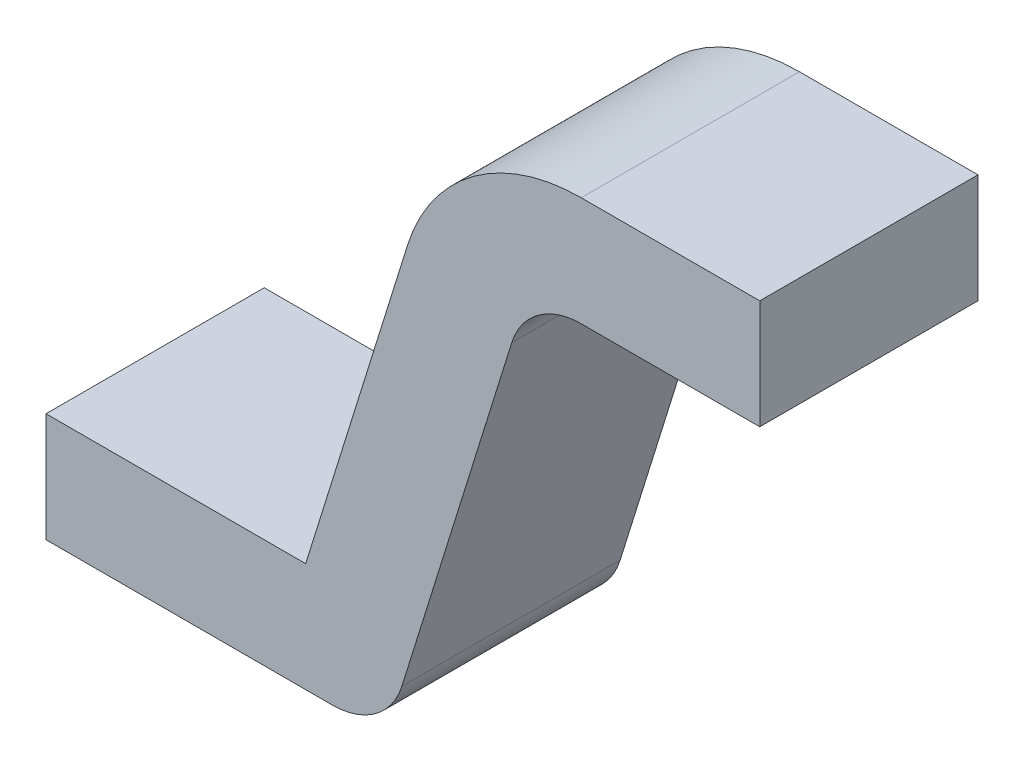
ISO-10303-21;
HEADER;
FILE_DESCRIPTION(('STEP AP214'),'2;1');
FILE_NAME('part.step','',(''),(''),'','','');
FILE_SCHEMA(('AUTOMOTIVE_DESIGN { 1 0 10303 214 1 1 1 1 }'));
ENDSEC;
DATA;
#1=APPLICATION_CONTEXT('core data for automotive mechanical design processes');
#2=APPLICATION_PROTOCOL_DEFINITION('international standard','automotive_design',2000,#1);
#3=PRODUCT_CONTEXT('',#1,'mechanical');
#4=PRODUCT('Part','Part','',(#3));
#5=PRODUCT_RELATED_PRODUCT_CATEGORY('part','',(#4));
#6=PRODUCT_DEFINITION_FORMATION('','',#4);
#7=PRODUCT_DEFINITION_CONTEXT('part definition',#1,'design');
#8=PRODUCT_DEFINITION('design','',#6,#7);
#9=PRODUCT_DEFINITION_SHAPE('','',#8);
#10=(LENGTH_UNIT() NAMED_UNIT(*) SI_UNIT(.MILLI.,.METRE.));
#11=(NAMED_UNIT(*) PLANE_ANGLE_UNIT() SI_UNIT($,.RADIAN.));
#12=(NAMED_UNIT(*) SI_UNIT($,.STERADIAN.) SOLID_ANGLE_UNIT());
#13=UNCERTAINTY_MEASURE_WITH_UNIT(LENGTH_MEASURE(1.E-05),#10,'distance_accuracy_value','');
#14=(GEOMETRIC_REPRESENTATION_CONTEXT(3) GLOBAL_UNCERTAINTY_ASSIGNED_CONTEXT((#13)) GLOBAL_UNIT_ASSIGNED_CONTEXT((#10,
#11,#12)) REPRESENTATION_CONTEXT('',''));
#15=CARTESIAN_POINT('',(0.,0.,0.));
#16=DIRECTION('',(0.,0.,1.));
#17=DIRECTION('',(1.,0.,0.));
#18=AXIS2_PLACEMENT_3D('',#15,#16,#17);
#19=CARTESIAN_POINT('',(0.,0.15,0.3));
#20=DIRECTION('',(1.,0.,0.));
#21=DIRECTION('',(0.,0.,-1.));
#22=AXIS2_PLACEMENT_3D('',#19,#20,#21);
#23=PLANE('',#22);
#24=DIRECTION('',(0.,-1.,0.));
#25=VECTOR('',#24,1.);
#26=CARTESIAN_POINT('',(0.,0.15,0.));
#27=LINE('',#26,#25);
#28=CARTESIAN_POINT('',(0.,0.15,0.));
#29=VERTEX_POINT('',#28);
#30=CARTESIAN_POINT('',(0.,0.,0.));
#31=VERTEX_POINT('',#30);
#32=EDGE_CURVE('E145',#29,#31,#27,.T.);
#33=ORIENTED_EDGE('',*,*,#32,.T.);
#34=DIRECTION('',(0.,0.,-1.));
#35=VECTOR('',#34,1.);
#36=CARTESIAN_POINT('',(0.,0.,0.3));
#37=LINE('',#36,#35);
#38=CARTESIAN_POINT('',(0.,0.,0.3));
#39=VERTEX_POINT('',#38);
#40=EDGE_CURVE('E11',#39,#31,#37,.T.);
#41=ORIENTED_EDGE('',*,*,#40,.F.);
#42=DIRECTION('',(0.,-1.,0.));
#43=VECTOR('',#42,1.);
#44=CARTESIAN_POINT('',(0.,0.15,0.3));
#45=LINE('',#44,#43);
#46=CARTESIAN_POINT('',(0.,0.15,0.3));
#47=VERTEX_POINT('',#46);
#48=EDGE_CURVE('E165',#47,#39,#45,.T.);
#49=ORIENTED_EDGE('',*,*,#48,.F.);
#50=DIRECTION('',(0.,0.,-1.));
#51=VECTOR('',#50,1.);
#52=CARTESIAN_POINT('',(0.,0.15,0.3));
#53=LINE('',#52,#51);
#54=EDGE_CURVE('E141',#47,#29,#53,.T.);
#55=ORIENTED_EDGE('',*,*,#54,.T.);
#56=EDGE_LOOP('',(#33,#41,#49,#55));
#57=FACE_BOUND('',#56,.T.);
#58=ADVANCED_FACE('F31',(#57),#23,.F.);
#59=CARTESIAN_POINT('',(0.,0.,0.3));
#60=DIRECTION('',(0.,1.,0.));
#61=DIRECTION('',(0.,0.,1.));
#62=AXIS2_PLACEMENT_3D('',#59,#60,#61);
#63=PLANE('',#62);
#64=DIRECTION('',(1.,0.,0.));
#65=VECTOR('',#64,1.);
#66=CARTESIAN_POINT('',(0.,0.,0.));
#67=LINE('',#66,#65);
#68=CARTESIAN_POINT('',(0.393749668926178,0.,0.));
#69=VERTEX_POINT('',#68);
#70=EDGE_CURVE('E148',#31,#69,#67,.T.);
#71=ORIENTED_EDGE('',*,*,#70,.T.);
#72=DIRECTION('',(0.,0.,-1.));
#73=VECTOR('',#72,1.);
#74=CARTESIAN_POINT('',(0.393749668926178,0.,0.3));
#75=LINE('',#74,#73);
#76=CARTESIAN_POINT('',(0.393749668926178,0.,0.3));
#77=VERTEX_POINT('',#76);
#78=EDGE_CURVE('E39',#77,#69,#75,.T.);
#79=ORIENTED_EDGE('',*,*,#78,.F.);
#80=DIRECTION('',(1.,0.,0.));
#81=VECTOR('',#80,1.);
#82=CARTESIAN_POINT('',(0.,0.,0.3));
#83=LINE('',#82,#81);
#84=EDGE_CURVE('E99',#39,#77,#83,.T.);
#85=ORIENTED_EDGE('',*,*,#84,.F.);
#86=ORIENTED_EDGE('',*,*,#40,.T.);
#87=EDGE_LOOP('',(#71,#79,#85,#86));
#88=FACE_BOUND('',#87,.T.);
#89=ADVANCED_FACE('F237',(#88),#63,.F.);
#90=CARTESIAN_POINT('',(0.393749668926178,0.1,0.3));
#91=DIRECTION('',(0.,0.,-1.));
#92=DIRECTION('',(-1.,0.,0.));
#93=AXIS2_PLACEMENT_3D('',#90,#91,#92);
#94=CYLINDRICAL_SURFACE('',#93,0.1);
#95=CARTESIAN_POINT('',(0.393749668926178,0.1,0.));
#96=DIRECTION('',(0.,0.,1.));
#97=DIRECTION('',(-1.,0.,0.));
#98=AXIS2_PLACEMENT_3D('',#95,#96,#97);
#99=CIRCLE('',#98,0.1);
#100=CARTESIAN_POINT('',(0.489218964277052,0.0702407384969382,0.));
#101=VERTEX_POINT('',#100);
#102=EDGE_CURVE('E150',#69,#101,#99,.T.);
#103=ORIENTED_EDGE('',*,*,#102,.T.);
#104=DIRECTION('',(0.,0.,-1.));
#105=VECTOR('',#104,1.);
#106=CARTESIAN_POINT('',(0.489218964277052,0.0702407384969382,0.3));
#107=LINE('',#106,#105);
#108=CARTESIAN_POINT('',(0.489218964277052,0.0702407384969382,0.3));
#109=VERTEX_POINT('',#108);
#110=EDGE_CURVE('E181',#109,#101,#107,.T.);
#111=ORIENTED_EDGE('',*,*,#110,.F.);
#112=CARTESIAN_POINT('',(0.393749668926178,0.1,0.3));
#113=DIRECTION('',(0.,0.,1.));
#114=DIRECTION('',(-1.,0.,0.));
#115=AXIS2_PLACEMENT_3D('',#112,#113,#114);
#116=CIRCLE('',#115,0.1);
#117=EDGE_CURVE('E189',#77,#109,#116,.T.);
#118=ORIENTED_EDGE('',*,*,#117,.F.);
#119=ORIENTED_EDGE('',*,*,#78,.T.);
#120=EDGE_LOOP('',(#103,#111,#118,#119));
#121=FACE_BOUND('',#120,.T.);
#122=ADVANCED_FACE('F187',(#121),#94,.T.);
#123=CARTESIAN_POINT('',(0.489218964277052,0.0702407384969381,0.3));
#124=DIRECTION('',(-0.954692953508738,0.297592615030619,0.));
#125=DIRECTION('',(-0.297592615030619,-0.954692953508738,0.));
#126=AXIS2_PLACEMENT_3D('',#123,#124,#125);
#127=PLANE('',#126);
#128=DIRECTION('',(0.297592615030619,0.954692953508738,0.));
#129=VECTOR('',#128,1.);
#130=CARTESIAN_POINT('',(0.489218964277052,0.0702407384969381,0.));
#131=LINE('',#130,#129);
#132=CARTESIAN_POINT('',(0.640250909953653,0.554759261503062,0.));
#133=VERTEX_POINT('',#132);
#134=EDGE_CURVE('E152',#101,#133,#131,.T.);
#135=ORIENTED_EDGE('',*,*,#134,.T.);
#136=DIRECTION('',(0.,0.,-1.));
#137=VECTOR('',#136,1.);
#138=CARTESIAN_POINT('',(0.640250909953653,0.554759261503062,0.3));
#139=LINE('',#138,#137);
#140=CARTESIAN_POINT('',(0.640250909953653,0.554759261503062,0.3));
#141=VERTEX_POINT('',#140);
#142=EDGE_CURVE('E178',#141,#133,#139,.T.);
#143=ORIENTED_EDGE('',*,*,#142,.F.);
#144=DIRECTION('',(0.297592615030619,0.954692953508738,0.));
#145=VECTOR('',#144,1.);
#146=CARTESIAN_POINT('',(0.489218964277052,0.0702407384969381,0.3));
#147=LINE('',#146,#145);
#148=EDGE_CURVE('E207',#109,#141,#147,.T.);
#149=ORIENTED_EDGE('',*,*,#148,.F.);
#150=ORIENTED_EDGE('',*,*,#110,.T.);
#151=EDGE_LOOP('',(#135,#143,#149,#150));
#152=FACE_BOUND('',#151,.T.);
#153=ADVANCED_FACE('F198',(#152),#127,.F.);
#154=CARTESIAN_POINT('',(0.735720205304527,0.525,0.3));
#155=DIRECTION('',(0.,0.,-1.));
#156=DIRECTION('',(-1.,0.,0.));
#157=AXIS2_PLACEMENT_3D('',#154,#155,#156);
#158=CYLINDRICAL_SURFACE('',#157,0.1);
#159=CARTESIAN_POINT('',(0.735720205304527,0.525,0.));
#160=DIRECTION('',(0.,0.,-1.));
#161=DIRECTION('',(1.,0.,0.));
#162=AXIS2_PLACEMENT_3D('',#159,#160,#161);
#163=CIRCLE('',#162,0.1);
#164=CARTESIAN_POINT('',(0.735720205304527,0.625,0.));
#165=VERTEX_POINT('',#164);
#166=EDGE_CURVE('E154',#133,#165,#163,.T.);
#167=ORIENTED_EDGE('',*,*,#166,.T.);
#168=DIRECTION('',(0.,0.,-1.));
#169=VECTOR('',#168,1.);
#170=CARTESIAN_POINT('',(0.735720205304527,0.625,0.3));
#171=LINE('',#170,#169);
#172=CARTESIAN_POINT('',(0.735720205304527,0.625,0.3));
#173=VERTEX_POINT('',#172);
#174=EDGE_CURVE('E175',#173,#165,#171,.T.);
#175=ORIENTED_EDGE('',*,*,#174,.F.);
#176=CARTESIAN_POINT('',(0.735720205304527,0.525,0.3));
#177=DIRECTION('',(0.,0.,-1.));
#178=DIRECTION('',(1.,0.,0.));
#179=AXIS2_PLACEMENT_3D('',#176,#177,#178);
#180=CIRCLE('',#179,0.1);
#181=EDGE_CURVE('E204',#141,#173,#180,.T.);
#182=ORIENTED_EDGE('',*,*,#181,.F.);
#183=ORIENTED_EDGE('',*,*,#142,.T.);
#184=EDGE_LOOP('',(#167,#175,#182,#183));
#185=FACE_BOUND('',#184,.T.);
#186=ADVANCED_FACE('F202',(#185),#158,.F.);
#187=CARTESIAN_POINT('',(0.735720205304527,0.625,0.3));
#188=DIRECTION('',(0.,1.,0.));
#189=DIRECTION('',(-1.,0.,0.));
#190=AXIS2_PLACEMENT_3D('',#187,#188,#189);
#191=PLANE('',#190);
#192=DIRECTION('',(1.,0.,0.));
#193=VECTOR('',#192,1.);
#194=CARTESIAN_POINT('',(0.735720205304527,0.625,0.));
#195=LINE('',#194,#193);
#196=CARTESIAN_POINT('',(0.981168201486143,0.625,0.));
#197=VERTEX_POINT('',#196);
#198=EDGE_CURVE('E156',#165,#197,#195,.T.);
#199=ORIENTED_EDGE('',*,*,#198,.T.);
#200=DIRECTION('',(0.,0.,-1.));
#201=VECTOR('',#200,1.);
#202=CARTESIAN_POINT('',(0.981168201486143,0.625,0.3));
#203=LINE('',#202,#201);
#204=CARTESIAN_POINT('',(0.981168201486143,0.625,0.3));
#205=VERTEX_POINT('',#204);
#206=EDGE_CURVE('E172',#205,#197,#203,.T.);
#207=ORIENTED_EDGE('',*,*,#206,.F.);
#208=DIRECTION('',(1.,0.,0.));
#209=VECTOR('',#208,1.);
#210=CARTESIAN_POINT('',(0.735720205304527,0.625,0.3));
#211=LINE('',#210,#209);
#212=EDGE_CURVE('E206',#173,#205,#211,.T.);
#213=ORIENTED_EDGE('',*,*,#212,.F.);
#214=ORIENTED_EDGE('',*,*,#174,.T.);
#215=EDGE_LOOP('',(#199,#207,#213,#214));
#216=FACE_BOUND('',#215,.T.);
#217=ADVANCED_FACE('F250',(#216),#191,.F.);
#218=CARTESIAN_POINT('',(0.981168201486143,0.775,0.3));
#219=DIRECTION('',(-1.,0.,0.));
#220=DIRECTION('',(0.,0.,1.));
#221=AXIS2_PLACEMENT_3D('',#218,#219,#220);
#222=PLANE('',#221);
#223=DIRECTION('',(0.,1.,0.));
#224=VECTOR('',#223,1.);
#225=CARTESIAN_POINT('',(0.981168201486143,0.775,0.));
#226=LINE('',#225,#224);
#227=CARTESIAN_POINT('',(0.981168201486143,0.775,0.));
#228=VERTEX_POINT('',#227);
#229=EDGE_CURVE('E158',#197,#228,#226,.T.);
#230=ORIENTED_EDGE('',*,*,#229,.T.);
#231=DIRECTION('',(0.,0.,-1.));
#232=VECTOR('',#231,1.);
#233=CARTESIAN_POINT('',(0.981168201486143,0.775,0.3));
#234=LINE('',#233,#232);
#235=CARTESIAN_POINT('',(0.981168201486143,0.775,0.3));
#236=VERTEX_POINT('',#235);
#237=EDGE_CURVE('E169',#236,#228,#234,.T.);
#238=ORIENTED_EDGE('',*,*,#237,.F.);
#239=DIRECTION('',(0.,1.,0.));
#240=VECTOR('',#239,1.);
#241=CARTESIAN_POINT('',(0.981168201486143,0.775,0.3));
#242=LINE('',#241,#240);
#243=EDGE_CURVE('E209',#205,#236,#242,.T.);
#244=ORIENTED_EDGE('',*,*,#243,.F.);
#245=ORIENTED_EDGE('',*,*,#206,.T.);
#246=EDGE_LOOP('',(#230,#238,#244,#245));
#247=FACE_BOUND('',#246,.T.);
#248=ADVANCED_FACE('F218',(#247),#222,.F.);
#249=CARTESIAN_POINT('',(0.735720205304527,0.775,0.3));
#250=DIRECTION('',(0.,-1.,0.));
#251=DIRECTION('',(0.,0.,-1.));
#252=AXIS2_PLACEMENT_3D('',#249,#250,#251);
#253=PLANE('',#252);
#254=DIRECTION('',(-1.,0.,0.));
#255=VECTOR('',#254,1.);
#256=CARTESIAN_POINT('',(0.735720205304527,0.775,0.));
#257=LINE('',#256,#255);
#258=CARTESIAN_POINT('',(0.735720205304527,0.775,0.));
#259=VERTEX_POINT('',#258);
#260=EDGE_CURVE('E160',#228,#259,#257,.T.);
#261=ORIENTED_EDGE('',*,*,#260,.T.);
#262=DIRECTION('',(0.,0.,-1.));
#263=VECTOR('',#262,1.);
#264=CARTESIAN_POINT('',(0.735720205304527,0.775,0.3));
#265=LINE('',#264,#263);
#266=CARTESIAN_POINT('',(0.735720205304527,0.775,0.3));
#267=VERTEX_POINT('',#266);
#268=EDGE_CURVE('E136',#267,#259,#265,.T.);
#269=ORIENTED_EDGE('',*,*,#268,.F.);
#270=DIRECTION('',(-1.,0.,0.));
#271=VECTOR('',#270,1.);
#272=CARTESIAN_POINT('',(0.735720205304527,0.775,0.3));
#273=LINE('',#272,#271);
#274=EDGE_CURVE('E127',#236,#267,#273,.T.);
#275=ORIENTED_EDGE('',*,*,#274,.F.);
#276=ORIENTED_EDGE('',*,*,#237,.T.);
#277=EDGE_LOOP('',(#261,#269,#275,#276));
#278=FACE_BOUND('',#277,.T.);
#279=ADVANCED_FACE('F222',(#278),#253,.F.);
#280=CARTESIAN_POINT('',(0.735720205304527,0.525,0.3));
#281=DIRECTION('',(0.,0.,-1.));
#282=DIRECTION('',(-1.,0.,0.));
#283=AXIS2_PLACEMENT_3D('',#280,#281,#282);
#284=CYLINDRICAL_SURFACE('',#283,0.25);
#285=CARTESIAN_POINT('',(0.735720205304527,0.525,0.));
#286=DIRECTION('',(0.,0.,1.));
#287=DIRECTION('',(1.,0.,0.));
#288=AXIS2_PLACEMENT_3D('',#285,#286,#287);
#289=CIRCLE('',#288,0.25);
#290=CARTESIAN_POINT('',(0.497046966927342,0.599398153757655,0.));
#291=VERTEX_POINT('',#290);
#292=EDGE_CURVE('E135',#259,#291,#289,.T.);
#293=ORIENTED_EDGE('',*,*,#292,.T.);
#294=DIRECTION('',(0.,0.,-1.));
#295=VECTOR('',#294,1.);
#296=CARTESIAN_POINT('',(0.497046966927342,0.599398153757655,0.3));
#297=LINE('',#296,#295);
#298=CARTESIAN_POINT('',(0.497046966927342,0.599398153757655,0.3));
#299=VERTEX_POINT('',#298);
#300=EDGE_CURVE('E132',#299,#291,#297,.T.);
#301=ORIENTED_EDGE('',*,*,#300,.F.);
#302=CARTESIAN_POINT('',(0.735720205304527,0.525,0.3));
#303=DIRECTION('',(0.,0.,1.));
#304=DIRECTION('',(1.,0.,0.));
#305=AXIS2_PLACEMENT_3D('',#302,#303,#304);
#306=CIRCLE('',#305,0.25);
#307=EDGE_CURVE('E121',#267,#299,#306,.T.);
#308=ORIENTED_EDGE('',*,*,#307,.F.);
#309=ORIENTED_EDGE('',*,*,#268,.T.);
#310=EDGE_LOOP('',(#293,#301,#308,#309));
#311=FACE_BOUND('',#310,.T.);
#312=ADVANCED_FACE('F133',(#311),#284,.T.);
#313=CARTESIAN_POINT('',(0.356962585582374,0.15,0.3));
#314=DIRECTION('',(0.954692953508738,-0.297592615030619,0.));
#315=DIRECTION('',(0.297592615030619,0.954692953508738,0.));
#316=AXIS2_PLACEMENT_3D('',#313,#314,#315);
#317=PLANE('',#316);
#318=DIRECTION('',(-0.297592615030619,-0.954692953508739,0.));
#319=VECTOR('',#318,1.);
#320=CARTESIAN_POINT('',(0.356962585582374,0.15,0.));
#321=LINE('',#320,#319);
#322=CARTESIAN_POINT('',(0.356962585582374,0.15,0.));
#323=VERTEX_POINT('',#322);
#324=EDGE_CURVE('E85',#291,#323,#321,.T.);
#325=ORIENTED_EDGE('',*,*,#324,.T.);
#326=DIRECTION('',(0.,0.,-1.));
#327=VECTOR('',#326,1.);
#328=CARTESIAN_POINT('',(0.356962585582374,0.15,0.3));
#329=LINE('',#328,#327);
#330=CARTESIAN_POINT('',(0.356962585582374,0.15,0.3));
#331=VERTEX_POINT('',#330);
#332=EDGE_CURVE('E137',#331,#323,#329,.T.);
#333=ORIENTED_EDGE('',*,*,#332,.F.);
#334=DIRECTION('',(-0.297592615030619,-0.954692953508739,0.));
#335=VECTOR('',#334,1.);
#336=CARTESIAN_POINT('',(0.356962585582374,0.15,0.3));
#337=LINE('',#336,#335);
#338=EDGE_CURVE('E125',#299,#331,#337,.T.);
#339=ORIENTED_EDGE('',*,*,#338,.F.);
#340=ORIENTED_EDGE('',*,*,#300,.T.);
#341=EDGE_LOOP('',(#325,#333,#339,#340));
#342=FACE_BOUND('',#341,.T.);
#343=ADVANCED_FACE('F139',(#342),#317,.F.);
#344=CARTESIAN_POINT('',(0.,0.15,0.3));
#345=DIRECTION('',(0.,-1.,0.));
#346=DIRECTION('',(0.,0.,-1.));
#347=AXIS2_PLACEMENT_3D('',#344,#345,#346);
#348=PLANE('',#347);
#349=DIRECTION('',(-1.,0.,0.));
#350=VECTOR('',#349,1.);
#351=CARTESIAN_POINT('',(0.,0.15,0.));
#352=LINE('',#351,#350);
#353=EDGE_CURVE('E91',#323,#29,#352,.T.);
#354=ORIENTED_EDGE('',*,*,#353,.T.);
#355=ORIENTED_EDGE('',*,*,#54,.F.);
#356=DIRECTION('',(-1.,0.,0.));
#357=VECTOR('',#356,1.);
#358=CARTESIAN_POINT('',(0.,0.15,0.3));
#359=LINE('',#358,#357);
#360=EDGE_CURVE('E47',#331,#47,#359,.T.);
#361=ORIENTED_EDGE('',*,*,#360,.F.);
#362=ORIENTED_EDGE('',*,*,#332,.T.);
#363=EDGE_LOOP('',(#354,#355,#361,#362));
#364=FACE_BOUND('',#363,.T.);
#365=ADVANCED_FACE('F226',(#364),#348,.F.);
#366=CARTESIAN_POINT('',(0.393749668926178,0.1,0.3));
#367=DIRECTION('',(0.,0.,-1.));
#368=DIRECTION('',(-1.,0.,0.));
#369=AXIS2_PLACEMENT_3D('',#366,#367,#368);
#370=PLANE('',#369);
#371=ORIENTED_EDGE('',*,*,#48,.T.);
#372=ORIENTED_EDGE('',*,*,#84,.T.);
#373=ORIENTED_EDGE('',*,*,#117,.T.);
#374=ORIENTED_EDGE('',*,*,#148,.T.);
#375=ORIENTED_EDGE('',*,*,#181,.T.);
#376=ORIENTED_EDGE('',*,*,#212,.T.);
#377=ORIENTED_EDGE('',*,*,#243,.T.);
#378=ORIENTED_EDGE('',*,*,#274,.T.);
#379=ORIENTED_EDGE('',*,*,#307,.T.);
#380=ORIENTED_EDGE('',*,*,#338,.T.);
#381=ORIENTED_EDGE('',*,*,#360,.T.);
#382=EDGE_LOOP('',(#371,#372,#373,#374,#375,#376,#377,#378,#379,#380,#381));
#383=FACE_BOUND('',#382,.T.);
#384=ADVANCED_FACE('F123',(#383),#370,.F.);
#385=CARTESIAN_POINT('',(0.393749668926178,0.1,0.));
#386=DIRECTION('',(0.,0.,-1.));
#387=DIRECTION('',(-1.,0.,0.));
#388=AXIS2_PLACEMENT_3D('',#385,#386,#387);
#389=PLANE('',#388);
#390=ORIENTED_EDGE('',*,*,#32,.F.);
#391=ORIENTED_EDGE('',*,*,#353,.F.);
#392=ORIENTED_EDGE('',*,*,#324,.F.);
#393=ORIENTED_EDGE('',*,*,#292,.F.);
#394=ORIENTED_EDGE('',*,*,#260,.F.);
#395=ORIENTED_EDGE('',*,*,#229,.F.);
#396=ORIENTED_EDGE('',*,*,#198,.F.);
#397=ORIENTED_EDGE('',*,*,#166,.F.);
#398=ORIENTED_EDGE('',*,*,#134,.F.);
#399=ORIENTED_EDGE('',*,*,#102,.F.);
#400=ORIENTED_EDGE('',*,*,#70,.F.);
#401=EDGE_LOOP('',(#390,#391,#392,#393,#394,#395,#396,#397,#398,#399,#400));
#402=FACE_BOUND('',#401,.T.);
#403=ADVANCED_FACE('F193',(#402),#389,.T.);
#404=CLOSED_SHELL('',(#58,#89,#122,#153,#186,#217,#248,#279,#312,#343,#365,#384,#403));
#405=MANIFOLD_SOLID_BREP('B2',#404);
#406=ADVANCED_BREP_SHAPE_REPRESENTATION('',(#18,#405),#14);
#407=SHAPE_DEFINITION_REPRESENTATION(#9,#406);
ENDSEC;
END-ISO-10303-21;
